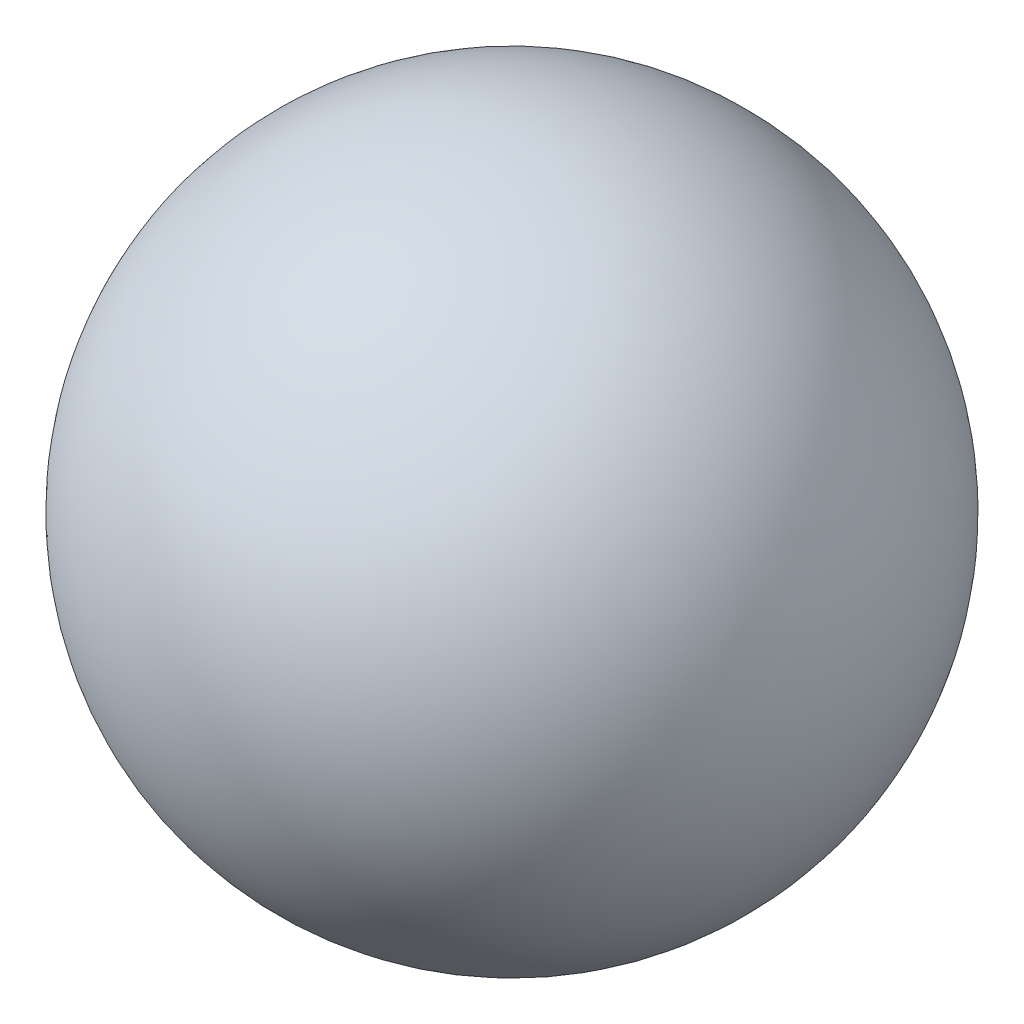
ISO-10303-21;
HEADER;
FILE_DESCRIPTION(('STEP AP214'),'2;1');
FILE_NAME('part.step','',(''),(''),'','','');
FILE_SCHEMA(('AUTOMOTIVE_DESIGN { 1 0 10303 214 1 1 1 1 }'));
ENDSEC;
DATA;
#1=APPLICATION_CONTEXT('core data for automotive mechanical design processes');
#2=APPLICATION_PROTOCOL_DEFINITION('international standard','automotive_design',2000,#1);
#3=PRODUCT_CONTEXT('',#1,'mechanical');
#4=PRODUCT('Part','Part','',(#3));
#5=PRODUCT_RELATED_PRODUCT_CATEGORY('part','',(#4));
#6=PRODUCT_DEFINITION_FORMATION('','',#4);
#7=PRODUCT_DEFINITION_CONTEXT('part definition',#1,'design');
#8=PRODUCT_DEFINITION('design','',#6,#7);
#9=PRODUCT_DEFINITION_SHAPE('','',#8);
#10=(LENGTH_UNIT() NAMED_UNIT(*) SI_UNIT(.MILLI.,.METRE.));
#11=(NAMED_UNIT(*) PLANE_ANGLE_UNIT() SI_UNIT($,.RADIAN.));
#12=(NAMED_UNIT(*) SI_UNIT($,.STERADIAN.) SOLID_ANGLE_UNIT());
#13=UNCERTAINTY_MEASURE_WITH_UNIT(LENGTH_MEASURE(1.E-05),#10,'distance_accuracy_value','');
#14=(GEOMETRIC_REPRESENTATION_CONTEXT(3) GLOBAL_UNCERTAINTY_ASSIGNED_CONTEXT((#13)) GLOBAL_UNIT_ASSIGNED_CONTEXT((#10,
#11,#12)) REPRESENTATION_CONTEXT('',''));
#15=CARTESIAN_POINT('',(0.,0.,0.));
#16=DIRECTION('',(0.,0.,1.));
#17=DIRECTION('',(1.,0.,0.));
#18=AXIS2_PLACEMENT_3D('',#15,#16,#17);
#19=CARTESIAN_POINT('',(-275.,0.,0.));
#20=DIRECTION('',(1.,0.,0.));
#21=DIRECTION('',(0.,0.,-1.));
#22=AXIS2_PLACEMENT_3D('',#19,#20,#21);
#23=SPHERICAL_SURFACE('',#22,275.);
#24=CARTESIAN_POINT('',(0.,0.,0.));
#25=VERTEX_POINT('',#24);
#26=VERTEX_LOOP('',#25);
#27=FACE_BOUND('',#26,.T.);
#28=ADVANCED_FACE('F29',(#27),#23,.T.);
#29=CLOSED_SHELL('',(#28));
#30=MANIFOLD_SOLID_BREP('B2',#29);
#31=ADVANCED_BREP_SHAPE_REPRESENTATION('',(#18,#30),#14);
#32=SHAPE_DEFINITION_REPRESENTATION(#9,#31);
ENDSEC;
END-ISO-10303-21;
